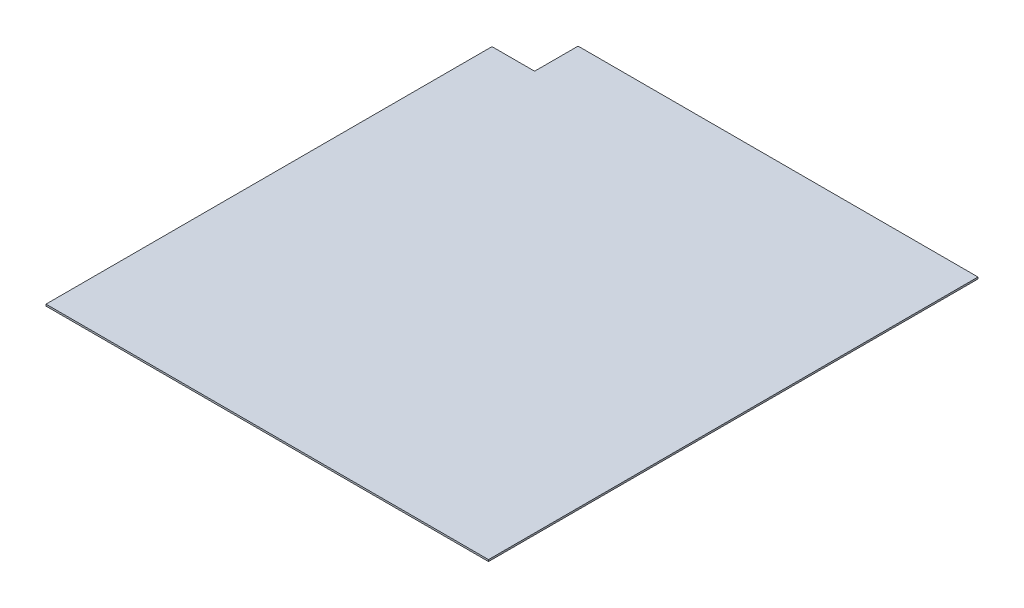
ISO-10303-21;
HEADER;
FILE_DESCRIPTION(('STEP AP214'),'2;1');
FILE_NAME('part.step','',(''),(''),'','','');
FILE_SCHEMA(('AUTOMOTIVE_DESIGN { 1 0 10303 214 1 1 1 1 }'));
ENDSEC;
DATA;
#1=APPLICATION_CONTEXT('core data for automotive mechanical design processes');
#2=APPLICATION_PROTOCOL_DEFINITION('international standard','automotive_design',2000,#1);
#3=PRODUCT_CONTEXT('',#1,'mechanical');
#4=PRODUCT('Part','Part','',(#3));
#5=PRODUCT_RELATED_PRODUCT_CATEGORY('part','',(#4));
#6=PRODUCT_DEFINITION_FORMATION('','',#4);
#7=PRODUCT_DEFINITION_CONTEXT('part definition',#1,'design');
#8=PRODUCT_DEFINITION('design','',#6,#7);
#9=PRODUCT_DEFINITION_SHAPE('','',#8);
#10=(LENGTH_UNIT() NAMED_UNIT(*) SI_UNIT(.MILLI.,.METRE.));
#11=(NAMED_UNIT(*) PLANE_ANGLE_UNIT() SI_UNIT($,.RADIAN.));
#12=(NAMED_UNIT(*) SI_UNIT($,.STERADIAN.) SOLID_ANGLE_UNIT());
#13=UNCERTAINTY_MEASURE_WITH_UNIT(LENGTH_MEASURE(1.E-05),#10,'distance_accuracy_value','');
#14=(GEOMETRIC_REPRESENTATION_CONTEXT(3) GLOBAL_UNCERTAINTY_ASSIGNED_CONTEXT((#13)) GLOBAL_UNIT_ASSIGNED_CONTEXT((#10,
#11,#12)) REPRESENTATION_CONTEXT('',''));
#15=CARTESIAN_POINT('',(0.,0.,0.));
#16=DIRECTION('',(0.,0.,1.));
#17=DIRECTION('',(1.,0.,0.));
#18=AXIS2_PLACEMENT_3D('',#15,#16,#17);
#19=CARTESIAN_POINT('',(0.,6.35,0.));
#20=DIRECTION('',(1.,0.,0.));
#21=DIRECTION('',(0.,0.,-1.));
#22=AXIS2_PLACEMENT_3D('',#19,#20,#21);
#23=PLANE('',#22);
#24=DIRECTION('',(0.,0.,1.));
#25=VECTOR('',#24,1.);
#26=CARTESIAN_POINT('',(0.,0.,0.));
#27=LINE('',#26,#25);
#28=CARTESIAN_POINT('',(0.,0.,-1625.6));
#29=VERTEX_POINT('',#28);
#30=CARTESIAN_POINT('',(0.,0.,0.));
#31=VERTEX_POINT('',#30);
#32=EDGE_CURVE('E137',#29,#31,#27,.T.);
#33=ORIENTED_EDGE('',*,*,#32,.T.);
#34=DIRECTION('',(0.,-1.,0.));
#35=VECTOR('',#34,1.);
#36=CARTESIAN_POINT('',(0.,6.35,0.));
#37=LINE('',#36,#35);
#38=CARTESIAN_POINT('',(0.,6.35,0.));
#39=VERTEX_POINT('',#38);
#40=EDGE_CURVE('E11',#39,#31,#37,.T.);
#41=ORIENTED_EDGE('',*,*,#40,.F.);
#42=DIRECTION('',(0.,0.,1.));
#43=VECTOR('',#42,1.);
#44=CARTESIAN_POINT('',(0.,6.35,0.));
#45=LINE('',#44,#43);
#46=CARTESIAN_POINT('',(0.,6.35,-1625.6));
#47=VERTEX_POINT('',#46);
#48=EDGE_CURVE('E153',#47,#39,#45,.T.);
#49=ORIENTED_EDGE('',*,*,#48,.F.);
#50=DIRECTION('',(0.,-1.,0.));
#51=VECTOR('',#50,1.);
#52=CARTESIAN_POINT('',(0.,6.35,-1625.6));
#53=LINE('',#52,#51);
#54=EDGE_CURVE('E133',#47,#29,#53,.T.);
#55=ORIENTED_EDGE('',*,*,#54,.T.);
#56=EDGE_LOOP('',(#33,#41,#49,#55));
#57=FACE_BOUND('',#56,.T.);
#58=ADVANCED_FACE('F35',(#57),#23,.F.);
#59=CARTESIAN_POINT('',(0.,6.35,0.));
#60=DIRECTION('',(0.,0.,-1.));
#61=DIRECTION('',(-1.,0.,0.));
#62=AXIS2_PLACEMENT_3D('',#59,#60,#61);
#63=PLANE('',#62);
#64=DIRECTION('',(1.,0.,0.));
#65=VECTOR('',#64,1.);
#66=CARTESIAN_POINT('',(0.,0.,0.));
#67=LINE('',#66,#65);
#68=CARTESIAN_POINT('',(1616.075,0.,0.));
#69=VERTEX_POINT('',#68);
#70=EDGE_CURVE('E140',#31,#69,#67,.T.);
#71=ORIENTED_EDGE('',*,*,#70,.T.);
#72=DIRECTION('',(0.,-1.,0.));
#73=VECTOR('',#72,1.);
#74=CARTESIAN_POINT('',(1616.075,6.35,0.));
#75=LINE('',#74,#73);
#76=CARTESIAN_POINT('',(1616.075,6.35,0.));
#77=VERTEX_POINT('',#76);
#78=EDGE_CURVE('E43',#77,#69,#75,.T.);
#79=ORIENTED_EDGE('',*,*,#78,.F.);
#80=DIRECTION('',(1.,0.,0.));
#81=VECTOR('',#80,1.);
#82=CARTESIAN_POINT('',(0.,6.35,0.));
#83=LINE('',#82,#81);
#84=EDGE_CURVE('E97',#39,#77,#83,.T.);
#85=ORIENTED_EDGE('',*,*,#84,.F.);
#86=ORIENTED_EDGE('',*,*,#40,.T.);
#87=EDGE_LOOP('',(#71,#79,#85,#86));
#88=FACE_BOUND('',#87,.T.);
#89=ADVANCED_FACE('F196',(#88),#63,.F.);
#90=CARTESIAN_POINT('',(1616.075,6.35,0.));
#91=DIRECTION('',(-1.,0.,0.));
#92=DIRECTION('',(0.,0.,1.));
#93=AXIS2_PLACEMENT_3D('',#90,#91,#92);
#94=PLANE('',#93);
#95=DIRECTION('',(0.,0.,-1.));
#96=VECTOR('',#95,1.);
#97=CARTESIAN_POINT('',(1616.075,0.,0.));
#98=LINE('',#97,#96);
#99=CARTESIAN_POINT('',(1616.075,0.,-1787.525));
#100=VERTEX_POINT('',#99);
#101=EDGE_CURVE('E142',#69,#100,#98,.T.);
#102=ORIENTED_EDGE('',*,*,#101,.T.);
#103=DIRECTION('',(0.,-1.,0.));
#104=VECTOR('',#103,1.);
#105=CARTESIAN_POINT('',(1616.075,6.35,-1787.525));
#106=LINE('',#105,#104);
#107=CARTESIAN_POINT('',(1616.075,6.35,-1787.525));
#108=VERTEX_POINT('',#107);
#109=EDGE_CURVE('E163',#108,#100,#106,.T.);
#110=ORIENTED_EDGE('',*,*,#109,.F.);
#111=DIRECTION('',(0.,0.,-1.));
#112=VECTOR('',#111,1.);
#113=CARTESIAN_POINT('',(1616.075,6.35,0.));
#114=LINE('',#113,#112);
#115=EDGE_CURVE('E171',#77,#108,#114,.T.);
#116=ORIENTED_EDGE('',*,*,#115,.F.);
#117=ORIENTED_EDGE('',*,*,#78,.T.);
#118=EDGE_LOOP('',(#102,#110,#116,#117));
#119=FACE_BOUND('',#118,.T.);
#120=ADVANCED_FACE('F169',(#119),#94,.F.);
#121=CARTESIAN_POINT('',(158.75,6.35,-1787.525));
#122=DIRECTION('',(0.,0.,1.));
#123=DIRECTION('',(1.,0.,0.));
#124=AXIS2_PLACEMENT_3D('',#121,#122,#123);
#125=PLANE('',#124);
#126=DIRECTION('',(-1.,0.,0.));
#127=VECTOR('',#126,1.);
#128=CARTESIAN_POINT('',(158.75,0.,-1787.525));
#129=LINE('',#128,#127);
#130=CARTESIAN_POINT('',(158.75,0.,-1787.525));
#131=VERTEX_POINT('',#130);
#132=EDGE_CURVE('E144',#100,#131,#129,.T.);
#133=ORIENTED_EDGE('',*,*,#132,.T.);
#134=DIRECTION('',(0.,-1.,0.));
#135=VECTOR('',#134,1.);
#136=CARTESIAN_POINT('',(158.75,6.35,-1787.525));
#137=LINE('',#136,#135);
#138=CARTESIAN_POINT('',(158.75,6.35,-1787.525));
#139=VERTEX_POINT('',#138);
#140=EDGE_CURVE('E160',#139,#131,#137,.T.);
#141=ORIENTED_EDGE('',*,*,#140,.F.);
#142=DIRECTION('',(-1.,0.,0.));
#143=VECTOR('',#142,1.);
#144=CARTESIAN_POINT('',(158.75,6.35,-1787.525));
#145=LINE('',#144,#143);
#146=EDGE_CURVE('E187',#108,#139,#145,.T.);
#147=ORIENTED_EDGE('',*,*,#146,.F.);
#148=ORIENTED_EDGE('',*,*,#109,.T.);
#149=EDGE_LOOP('',(#133,#141,#147,#148));
#150=FACE_BOUND('',#149,.T.);
#151=ADVANCED_FACE('F180',(#150),#125,.F.);
#152=CARTESIAN_POINT('',(158.75,6.35,-1784.35));
#153=DIRECTION('',(0.,-1.,0.));
#154=DIRECTION('',(0.,0.,-1.));
#155=AXIS2_PLACEMENT_3D('',#152,#153,#154);
#156=CYLINDRICAL_SURFACE('',#155,3.17499999999986);
#157=CARTESIAN_POINT('',(158.75,0.,-1784.35));
#158=DIRECTION('',(0.,1.,0.));
#159=DIRECTION('',(0.,0.,-1.));
#160=AXIS2_PLACEMENT_3D('',#157,#158,#159);
#161=CIRCLE('',#160,3.17499999999986);
#162=CARTESIAN_POINT('',(155.575,0.,-1784.35));
#163=VERTEX_POINT('',#162);
#164=EDGE_CURVE('E146',#131,#163,#161,.T.);
#165=ORIENTED_EDGE('',*,*,#164,.T.);
#166=DIRECTION('',(0.,-1.,0.));
#167=VECTOR('',#166,1.);
#168=CARTESIAN_POINT('',(155.575,6.35,-1784.35));
#169=LINE('',#168,#167);
#170=CARTESIAN_POINT('',(155.575,6.35,-1784.35));
#171=VERTEX_POINT('',#170);
#172=EDGE_CURVE('E157',#171,#163,#169,.T.);
#173=ORIENTED_EDGE('',*,*,#172,.F.);
#174=CARTESIAN_POINT('',(158.75,6.35,-1784.35));
#175=DIRECTION('',(0.,1.,0.));
#176=DIRECTION('',(0.,0.,-1.));
#177=AXIS2_PLACEMENT_3D('',#174,#175,#176);
#178=CIRCLE('',#177,3.17499999999986);
#179=EDGE_CURVE('E186',#139,#171,#178,.T.);
#180=ORIENTED_EDGE('',*,*,#179,.F.);
#181=ORIENTED_EDGE('',*,*,#140,.T.);
#182=EDGE_LOOP('',(#165,#173,#180,#181));
#183=FACE_BOUND('',#182,.T.);
#184=ADVANCED_FACE('F184',(#183),#156,.T.);
#185=CARTESIAN_POINT('',(155.575,6.35,-1631.95));
#186=DIRECTION('',(1.,0.,0.));
#187=DIRECTION('',(0.,0.,-1.));
#188=AXIS2_PLACEMENT_3D('',#185,#186,#187);
#189=PLANE('',#188);
#190=DIRECTION('',(0.,0.,1.));
#191=VECTOR('',#190,1.);
#192=CARTESIAN_POINT('',(155.575,0.,-1631.95));
#193=LINE('',#192,#191);
#194=CARTESIAN_POINT('',(155.575,0.,-1631.95));
#195=VERTEX_POINT('',#194);
#196=EDGE_CURVE('E148',#163,#195,#193,.T.);
#197=ORIENTED_EDGE('',*,*,#196,.T.);
#198=DIRECTION('',(0.,-1.,0.));
#199=VECTOR('',#198,1.);
#200=CARTESIAN_POINT('',(155.575,6.35,-1631.95));
#201=LINE('',#200,#199);
#202=CARTESIAN_POINT('',(155.575,6.35,-1631.95));
#203=VERTEX_POINT('',#202);
#204=EDGE_CURVE('E128',#203,#195,#201,.T.);
#205=ORIENTED_EDGE('',*,*,#204,.F.);
#206=DIRECTION('',(0.,0.,1.));
#207=VECTOR('',#206,1.);
#208=CARTESIAN_POINT('',(155.575,6.35,-1631.95));
#209=LINE('',#208,#207);
#210=EDGE_CURVE('E119',#171,#203,#209,.T.);
#211=ORIENTED_EDGE('',*,*,#210,.F.);
#212=ORIENTED_EDGE('',*,*,#172,.T.);
#213=EDGE_LOOP('',(#197,#205,#211,#212));
#214=FACE_BOUND('',#213,.T.);
#215=ADVANCED_FACE('F208',(#214),#189,.F.);
#216=CARTESIAN_POINT('',(152.4,6.35,-1631.95));
#217=DIRECTION('',(0.,-1.,0.));
#218=DIRECTION('',(0.,0.,-1.));
#219=AXIS2_PLACEMENT_3D('',#216,#217,#218);
#220=CYLINDRICAL_SURFACE('',#219,3.17499999999997);
#221=CARTESIAN_POINT('',(152.4,0.,-1631.95));
#222=DIRECTION('',(0.,-1.,0.));
#223=DIRECTION('',(0.,0.,-1.));
#224=AXIS2_PLACEMENT_3D('',#221,#222,#223);
#225=CIRCLE('',#224,3.17499999999997);
#226=CARTESIAN_POINT('',(152.4,0.,-1628.775));
#227=VERTEX_POINT('',#226);
#228=EDGE_CURVE('E127',#195,#227,#225,.T.);
#229=ORIENTED_EDGE('',*,*,#228,.T.);
#230=DIRECTION('',(0.,-1.,0.));
#231=VECTOR('',#230,1.);
#232=CARTESIAN_POINT('',(152.4,6.35,-1628.775));
#233=LINE('',#232,#231);
#234=CARTESIAN_POINT('',(152.4,6.35,-1628.775));
#235=VERTEX_POINT('',#234);
#236=EDGE_CURVE('E124',#235,#227,#233,.T.);
#237=ORIENTED_EDGE('',*,*,#236,.F.);
#238=CARTESIAN_POINT('',(152.4,6.35,-1631.95));
#239=DIRECTION('',(0.,-1.,0.));
#240=DIRECTION('',(0.,0.,-1.));
#241=AXIS2_PLACEMENT_3D('',#238,#239,#240);
#242=CIRCLE('',#241,3.17499999999997);
#243=EDGE_CURVE('E113',#203,#235,#242,.T.);
#244=ORIENTED_EDGE('',*,*,#243,.F.);
#245=ORIENTED_EDGE('',*,*,#204,.T.);
#246=EDGE_LOOP('',(#229,#237,#244,#245));
#247=FACE_BOUND('',#246,.T.);
#248=ADVANCED_FACE('F125',(#247),#220,.F.);
#249=CARTESIAN_POINT('',(3.175,6.35,-1628.775));
#250=DIRECTION('',(0.,0.,1.));
#251=DIRECTION('',(1.,0.,0.));
#252=AXIS2_PLACEMENT_3D('',#249,#250,#251);
#253=PLANE('',#252);
#254=DIRECTION('',(-1.,0.,0.));
#255=VECTOR('',#254,1.);
#256=CARTESIAN_POINT('',(3.175,0.,-1628.775));
#257=LINE('',#256,#255);
#258=CARTESIAN_POINT('',(3.175,0.,-1628.775));
#259=VERTEX_POINT('',#258);
#260=EDGE_CURVE('E83',#227,#259,#257,.T.);
#261=ORIENTED_EDGE('',*,*,#260,.T.);
#262=DIRECTION('',(0.,-1.,0.));
#263=VECTOR('',#262,1.);
#264=CARTESIAN_POINT('',(3.175,6.35,-1628.775));
#265=LINE('',#264,#263);
#266=CARTESIAN_POINT('',(3.175,6.35,-1628.775));
#267=VERTEX_POINT('',#266);
#268=EDGE_CURVE('E129',#267,#259,#265,.T.);
#269=ORIENTED_EDGE('',*,*,#268,.F.);
#270=DIRECTION('',(-1.,0.,0.));
#271=VECTOR('',#270,1.);
#272=CARTESIAN_POINT('',(3.175,6.35,-1628.775));
#273=LINE('',#272,#271);
#274=EDGE_CURVE('E117',#235,#267,#273,.T.);
#275=ORIENTED_EDGE('',*,*,#274,.F.);
#276=ORIENTED_EDGE('',*,*,#236,.T.);
#277=EDGE_LOOP('',(#261,#269,#275,#276));
#278=FACE_BOUND('',#277,.T.);
#279=ADVANCED_FACE('F131',(#278),#253,.F.);
#280=CARTESIAN_POINT('',(3.175,6.35,-1625.6));
#281=DIRECTION('',(0.,-1.,0.));
#282=DIRECTION('',(0.,0.,-1.));
#283=AXIS2_PLACEMENT_3D('',#280,#281,#282);
#284=CYLINDRICAL_SURFACE('',#283,3.17499999999996);
#285=CARTESIAN_POINT('',(3.175,0.,-1625.6));
#286=DIRECTION('',(0.,1.,0.));
#287=DIRECTION('',(0.,0.,1.));
#288=AXIS2_PLACEMENT_3D('',#285,#286,#287);
#289=CIRCLE('',#288,3.17499999999996);
#290=EDGE_CURVE('E89',#259,#29,#289,.T.);
#291=ORIENTED_EDGE('',*,*,#290,.T.);
#292=ORIENTED_EDGE('',*,*,#54,.F.);
#293=CARTESIAN_POINT('',(3.175,6.35,-1625.6));
#294=DIRECTION('',(0.,1.,0.));
#295=DIRECTION('',(0.,0.,1.));
#296=AXIS2_PLACEMENT_3D('',#293,#294,#295);
#297=CIRCLE('',#296,3.17499999999996);
#298=EDGE_CURVE('E51',#267,#47,#297,.T.);
#299=ORIENTED_EDGE('',*,*,#298,.F.);
#300=ORIENTED_EDGE('',*,*,#268,.T.);
#301=EDGE_LOOP('',(#291,#292,#299,#300));
#302=FACE_BOUND('',#301,.T.);
#303=ADVANCED_FACE('F216',(#302),#284,.T.);
#304=CARTESIAN_POINT('',(3.175,6.35,-1625.6));
#305=DIRECTION('',(0.,1.,0.));
#306=DIRECTION('',(0.,0.,1.));
#307=AXIS2_PLACEMENT_3D('',#304,#305,#306);
#308=PLANE('',#307);
#309=ORIENTED_EDGE('',*,*,#48,.T.);
#310=ORIENTED_EDGE('',*,*,#84,.T.);
#311=ORIENTED_EDGE('',*,*,#115,.T.);
#312=ORIENTED_EDGE('',*,*,#146,.T.);
#313=ORIENTED_EDGE('',*,*,#179,.T.);
#314=ORIENTED_EDGE('',*,*,#210,.T.);
#315=ORIENTED_EDGE('',*,*,#243,.T.);
#316=ORIENTED_EDGE('',*,*,#274,.T.);
#317=ORIENTED_EDGE('',*,*,#298,.T.);
#318=EDGE_LOOP('',(#309,#310,#311,#312,#313,#314,#315,#316,#317));
#319=FACE_BOUND('',#318,.T.);
#320=ADVANCED_FACE('F115',(#319),#308,.T.);
#321=CARTESIAN_POINT('',(3.175,0.,-1625.6));
#322=DIRECTION('',(0.,1.,0.));
#323=DIRECTION('',(0.,0.,1.));
#324=AXIS2_PLACEMENT_3D('',#321,#322,#323);
#325=PLANE('',#324);
#326=ORIENTED_EDGE('',*,*,#32,.F.);
#327=ORIENTED_EDGE('',*,*,#290,.F.);
#328=ORIENTED_EDGE('',*,*,#260,.F.);
#329=ORIENTED_EDGE('',*,*,#228,.F.);
#330=ORIENTED_EDGE('',*,*,#196,.F.);
#331=ORIENTED_EDGE('',*,*,#164,.F.);
#332=ORIENTED_EDGE('',*,*,#132,.F.);
#333=ORIENTED_EDGE('',*,*,#101,.F.);
#334=ORIENTED_EDGE('',*,*,#70,.F.);
#335=EDGE_LOOP('',(#326,#327,#328,#329,#330,#331,#332,#333,#334));
#336=FACE_BOUND('',#335,.T.);
#337=ADVANCED_FACE('F175',(#336),#325,.F.);
#338=CLOSED_SHELL('',(#58,#89,#120,#151,#184,#215,#248,#279,#303,#320,#337));
#339=MANIFOLD_SOLID_BREP('B2',#338);
#340=ADVANCED_BREP_SHAPE_REPRESENTATION('',(#18,#339),#14);
#341=SHAPE_DEFINITION_REPRESENTATION(#9,#340);
ENDSEC;
END-ISO-10303-21;
